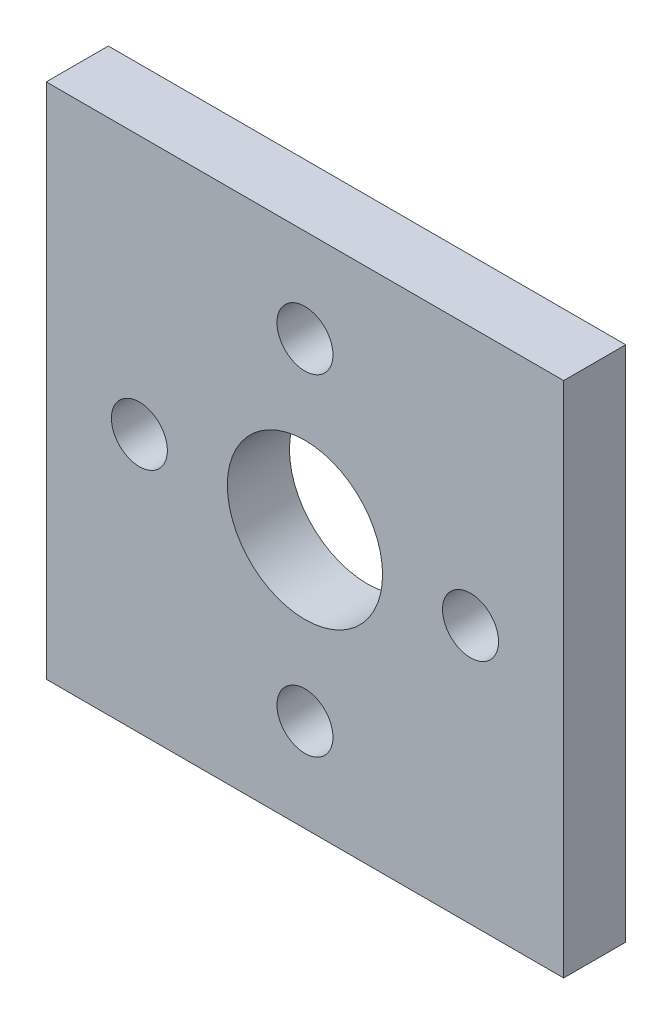
ISO-10303-21;
HEADER;
FILE_DESCRIPTION(('STEP AP214'),'2;1');
FILE_NAME('part.step','',(''),(''),'','','');
FILE_SCHEMA(('AUTOMOTIVE_DESIGN { 1 0 10303 214 1 1 1 1 }'));
ENDSEC;
DATA;
#1=APPLICATION_CONTEXT('core data for automotive mechanical design processes');
#2=APPLICATION_PROTOCOL_DEFINITION('international standard','automotive_design',2000,#1);
#3=PRODUCT_CONTEXT('',#1,'mechanical');
#4=PRODUCT('Part','Part','',(#3));
#5=PRODUCT_RELATED_PRODUCT_CATEGORY('part','',(#4));
#6=PRODUCT_DEFINITION_FORMATION('','',#4);
#7=PRODUCT_DEFINITION_CONTEXT('part definition',#1,'design');
#8=PRODUCT_DEFINITION('design','',#6,#7);
#9=PRODUCT_DEFINITION_SHAPE('','',#8);
#10=(LENGTH_UNIT() NAMED_UNIT(*) SI_UNIT(.MILLI.,.METRE.));
#11=(NAMED_UNIT(*) PLANE_ANGLE_UNIT() SI_UNIT($,.RADIAN.));
#12=(NAMED_UNIT(*) SI_UNIT($,.STERADIAN.) SOLID_ANGLE_UNIT());
#13=UNCERTAINTY_MEASURE_WITH_UNIT(LENGTH_MEASURE(1.E-05),#10,'distance_accuracy_value','');
#14=(GEOMETRIC_REPRESENTATION_CONTEXT(3) GLOBAL_UNCERTAINTY_ASSIGNED_CONTEXT((#13)) GLOBAL_UNIT_ASSIGNED_CONTEXT((#10,
#11,#12)) REPRESENTATION_CONTEXT('',''));
#15=CARTESIAN_POINT('',(0.,0.,0.));
#16=DIRECTION('',(0.,0.,1.));
#17=DIRECTION('',(1.,0.,0.));
#18=AXIS2_PLACEMENT_3D('',#15,#16,#17);
#19=CARTESIAN_POINT('',(0.,0.,3.));
#20=DIRECTION('',(0.,0.,1.));
#21=DIRECTION('',(1.,0.,0.));
#22=AXIS2_PLACEMENT_3D('',#19,#20,#21);
#23=PLANE('',#22);
#24=CARTESIAN_POINT('',(8.,0.,3.));
#25=DIRECTION('',(0.,0.,1.));
#26=DIRECTION('',(1.,0.,0.));
#27=AXIS2_PLACEMENT_3D('',#24,#25,#26);
#28=CIRCLE('',#27,1.35255);
#29=CARTESIAN_POINT('',(9.35255,0.,3.));
#30=VERTEX_POINT('',#29);
#31=EDGE_CURVE('E127',#30,#30,#28,.T.);
#32=ORIENTED_EDGE('',*,*,#31,.F.);
#33=EDGE_LOOP('',(#32));
#34=FACE_BOUND('',#33,.T.);
#35=CARTESIAN_POINT('',(0.,8.,3.));
#36=DIRECTION('',(0.,0.,1.));
#37=DIRECTION('',(1.,0.,0.));
#38=AXIS2_PLACEMENT_3D('',#35,#36,#37);
#39=CIRCLE('',#38,1.35255);
#40=CARTESIAN_POINT('',(1.35255,8.,3.));
#41=VERTEX_POINT('',#40);
#42=EDGE_CURVE('E115',#41,#41,#39,.T.);
#43=ORIENTED_EDGE('',*,*,#42,.F.);
#44=EDGE_LOOP('',(#43));
#45=FACE_BOUND('',#44,.T.);
#46=DIRECTION('',(0.,-1.,0.));
#47=VECTOR('',#46,1.);
#48=CARTESIAN_POINT('',(-12.5,12.5,3.));
#49=LINE('',#48,#47);
#50=CARTESIAN_POINT('',(-12.5,12.5,3.));
#51=VERTEX_POINT('',#50);
#52=CARTESIAN_POINT('',(-12.5,-12.5,3.));
#53=VERTEX_POINT('',#52);
#54=EDGE_CURVE('E85',#51,#53,#49,.T.);
#55=ORIENTED_EDGE('',*,*,#54,.T.);
#56=DIRECTION('',(1.,0.,0.));
#57=VECTOR('',#56,1.);
#58=CARTESIAN_POINT('',(-12.5,-12.5,3.));
#59=LINE('',#58,#57);
#60=CARTESIAN_POINT('',(12.5,-12.5,3.));
#61=VERTEX_POINT('',#60);
#62=EDGE_CURVE('E80',#53,#61,#59,.T.);
#63=ORIENTED_EDGE('',*,*,#62,.T.);
#64=DIRECTION('',(0.,1.,0.));
#65=VECTOR('',#64,1.);
#66=CARTESIAN_POINT('',(12.5,12.5,3.));
#67=LINE('',#66,#65);
#68=CARTESIAN_POINT('',(12.5,12.5,3.));
#69=VERTEX_POINT('',#68);
#70=EDGE_CURVE('E83',#61,#69,#67,.T.);
#71=ORIENTED_EDGE('',*,*,#70,.T.);
#72=DIRECTION('',(-1.,0.,0.));
#73=VECTOR('',#72,1.);
#74=CARTESIAN_POINT('',(-12.5,12.5,3.));
#75=LINE('',#74,#73);
#76=EDGE_CURVE('E50',#69,#51,#75,.T.);
#77=ORIENTED_EDGE('',*,*,#76,.T.);
#78=EDGE_LOOP('',(#55,#63,#71,#77));
#79=FACE_BOUND('',#78,.T.);
#80=CARTESIAN_POINT('',(0.,0.,3.));
#81=DIRECTION('',(0.,0.,1.));
#82=DIRECTION('',(1.,0.,0.));
#83=AXIS2_PLACEMENT_3D('',#80,#81,#82);
#84=CIRCLE('',#83,3.75);
#85=CARTESIAN_POINT('',(3.75,0.,3.));
#86=VERTEX_POINT('',#85);
#87=EDGE_CURVE('E100',#86,#86,#84,.T.);
#88=ORIENTED_EDGE('',*,*,#87,.F.);
#89=EDGE_LOOP('',(#88));
#90=FACE_BOUND('',#89,.T.);
#91=CARTESIAN_POINT('',(0.,-8.,3.));
#92=DIRECTION('',(0.,0.,1.));
#93=DIRECTION('',(1.,0.,0.));
#94=AXIS2_PLACEMENT_3D('',#91,#92,#93);
#95=CIRCLE('',#94,1.35255);
#96=CARTESIAN_POINT('',(1.35255,-8.,3.));
#97=VERTEX_POINT('',#96);
#98=EDGE_CURVE('E121',#97,#97,#95,.T.);
#99=ORIENTED_EDGE('',*,*,#98,.F.);
#100=EDGE_LOOP('',(#99));
#101=FACE_BOUND('',#100,.T.);
#102=CARTESIAN_POINT('',(-8.,0.,3.));
#103=DIRECTION('',(0.,0.,1.));
#104=DIRECTION('',(1.,0.,0.));
#105=AXIS2_PLACEMENT_3D('',#102,#103,#104);
#106=CIRCLE('',#105,1.35255);
#107=CARTESIAN_POINT('',(-6.64745,0.,3.));
#108=VERTEX_POINT('',#107);
#109=EDGE_CURVE('E133',#108,#108,#106,.T.);
#110=ORIENTED_EDGE('',*,*,#109,.F.);
#111=EDGE_LOOP('',(#110));
#112=FACE_BOUND('',#111,.T.);
#113=ADVANCED_FACE('F33',(#34,#45,#79,#90,#101,#112),#23,.T.);
#114=CARTESIAN_POINT('',(0.,0.,0.));
#115=DIRECTION('',(0.,0.,1.));
#116=DIRECTION('',(1.,0.,0.));
#117=AXIS2_PLACEMENT_3D('',#114,#115,#116);
#118=PLANE('',#117);
#119=DIRECTION('',(0.,-1.,0.));
#120=VECTOR('',#119,1.);
#121=CARTESIAN_POINT('',(-12.5,12.5,0.));
#122=LINE('',#121,#120);
#123=CARTESIAN_POINT('',(-12.5,12.5,0.));
#124=VERTEX_POINT('',#123);
#125=CARTESIAN_POINT('',(-12.5,-12.5,0.));
#126=VERTEX_POINT('',#125);
#127=EDGE_CURVE('E97',#124,#126,#122,.T.);
#128=ORIENTED_EDGE('',*,*,#127,.F.);
#129=DIRECTION('',(-1.,0.,0.));
#130=VECTOR('',#129,1.);
#131=CARTESIAN_POINT('',(-12.5,12.5,0.));
#132=LINE('',#131,#130);
#133=CARTESIAN_POINT('',(12.5,12.5,0.));
#134=VERTEX_POINT('',#133);
#135=EDGE_CURVE('E73',#134,#124,#132,.T.);
#136=ORIENTED_EDGE('',*,*,#135,.F.);
#137=DIRECTION('',(0.,1.,0.));
#138=VECTOR('',#137,1.);
#139=CARTESIAN_POINT('',(12.5,12.5,0.));
#140=LINE('',#139,#138);
#141=CARTESIAN_POINT('',(12.5,-12.5,0.));
#142=VERTEX_POINT('',#141);
#143=EDGE_CURVE('E67',#142,#134,#140,.T.);
#144=ORIENTED_EDGE('',*,*,#143,.F.);
#145=DIRECTION('',(1.,0.,0.));
#146=VECTOR('',#145,1.);
#147=CARTESIAN_POINT('',(-12.5,-12.5,0.));
#148=LINE('',#147,#146);
#149=EDGE_CURVE('E89',#126,#142,#148,.T.);
#150=ORIENTED_EDGE('',*,*,#149,.F.);
#151=EDGE_LOOP('',(#128,#136,#144,#150));
#152=FACE_BOUND('',#151,.T.);
#153=CARTESIAN_POINT('',(0.,0.,0.));
#154=DIRECTION('',(0.,0.,1.));
#155=DIRECTION('',(1.,0.,0.));
#156=AXIS2_PLACEMENT_3D('',#153,#154,#155);
#157=CIRCLE('',#156,3.75);
#158=CARTESIAN_POINT('',(3.75,0.,0.));
#159=VERTEX_POINT('',#158);
#160=EDGE_CURVE('E112',#159,#159,#157,.T.);
#161=ORIENTED_EDGE('',*,*,#160,.T.);
#162=EDGE_LOOP('',(#161));
#163=FACE_BOUND('',#162,.T.);
#164=CARTESIAN_POINT('',(0.,8.,0.));
#165=DIRECTION('',(0.,0.,1.));
#166=DIRECTION('',(1.,0.,0.));
#167=AXIS2_PLACEMENT_3D('',#164,#165,#166);
#168=CIRCLE('',#167,1.35255);
#169=CARTESIAN_POINT('',(1.35255,8.,0.));
#170=VERTEX_POINT('',#169);
#171=EDGE_CURVE('E118',#170,#170,#168,.T.);
#172=ORIENTED_EDGE('',*,*,#171,.T.);
#173=EDGE_LOOP('',(#172));
#174=FACE_BOUND('',#173,.T.);
#175=CARTESIAN_POINT('',(0.,-8.,0.));
#176=DIRECTION('',(0.,0.,1.));
#177=DIRECTION('',(1.,0.,0.));
#178=AXIS2_PLACEMENT_3D('',#175,#176,#177);
#179=CIRCLE('',#178,1.35255);
#180=CARTESIAN_POINT('',(1.35255,-8.,0.));
#181=VERTEX_POINT('',#180);
#182=EDGE_CURVE('E124',#181,#181,#179,.T.);
#183=ORIENTED_EDGE('',*,*,#182,.T.);
#184=EDGE_LOOP('',(#183));
#185=FACE_BOUND('',#184,.T.);
#186=CARTESIAN_POINT('',(8.,0.,0.));
#187=DIRECTION('',(0.,0.,1.));
#188=DIRECTION('',(1.,0.,0.));
#189=AXIS2_PLACEMENT_3D('',#186,#187,#188);
#190=CIRCLE('',#189,1.35255);
#191=CARTESIAN_POINT('',(9.35255,0.,0.));
#192=VERTEX_POINT('',#191);
#193=EDGE_CURVE('E130',#192,#192,#190,.T.);
#194=ORIENTED_EDGE('',*,*,#193,.T.);
#195=EDGE_LOOP('',(#194));
#196=FACE_BOUND('',#195,.T.);
#197=CARTESIAN_POINT('',(-8.,0.,0.));
#198=DIRECTION('',(0.,0.,1.));
#199=DIRECTION('',(1.,0.,0.));
#200=AXIS2_PLACEMENT_3D('',#197,#198,#199);
#201=CIRCLE('',#200,1.35255);
#202=CARTESIAN_POINT('',(-6.64745,0.,0.));
#203=VERTEX_POINT('',#202);
#204=EDGE_CURVE('E136',#203,#203,#201,.T.);
#205=ORIENTED_EDGE('',*,*,#204,.T.);
#206=EDGE_LOOP('',(#205));
#207=FACE_BOUND('',#206,.T.);
#208=ADVANCED_FACE('F108',(#152,#163,#174,#185,#196,#207),#118,.F.);
#209=CARTESIAN_POINT('',(-12.5,12.5,3.));
#210=DIRECTION('',(1.,0.,0.));
#211=DIRECTION('',(0.,1.,0.));
#212=AXIS2_PLACEMENT_3D('',#209,#210,#211);
#213=PLANE('',#212);
#214=ORIENTED_EDGE('',*,*,#127,.T.);
#215=DIRECTION('',(0.,0.,-1.));
#216=VECTOR('',#215,1.);
#217=CARTESIAN_POINT('',(-12.5,-12.5,3.));
#218=LINE('',#217,#216);
#219=EDGE_CURVE('E11',#53,#126,#218,.T.);
#220=ORIENTED_EDGE('',*,*,#219,.F.);
#221=ORIENTED_EDGE('',*,*,#54,.F.);
#222=DIRECTION('',(0.,0.,-1.));
#223=VECTOR('',#222,1.);
#224=CARTESIAN_POINT('',(-12.5,12.5,3.));
#225=LINE('',#224,#223);
#226=EDGE_CURVE('E93',#51,#124,#225,.T.);
#227=ORIENTED_EDGE('',*,*,#226,.T.);
#228=EDGE_LOOP('',(#214,#220,#221,#227));
#229=FACE_BOUND('',#228,.T.);
#230=ADVANCED_FACE('F35',(#229),#213,.F.);
#231=CARTESIAN_POINT('',(-12.5,-12.5,3.));
#232=DIRECTION('',(0.,1.,0.));
#233=DIRECTION('',(0.,0.,1.));
#234=AXIS2_PLACEMENT_3D('',#231,#232,#233);
#235=PLANE('',#234);
#236=ORIENTED_EDGE('',*,*,#149,.T.);
#237=DIRECTION('',(0.,0.,-1.));
#238=VECTOR('',#237,1.);
#239=CARTESIAN_POINT('',(12.5,-12.5,3.));
#240=LINE('',#239,#238);
#241=EDGE_CURVE('E42',#61,#142,#240,.T.);
#242=ORIENTED_EDGE('',*,*,#241,.F.);
#243=ORIENTED_EDGE('',*,*,#62,.F.);
#244=ORIENTED_EDGE('',*,*,#219,.T.);
#245=EDGE_LOOP('',(#236,#242,#243,#244));
#246=FACE_BOUND('',#245,.T.);
#247=ADVANCED_FACE('F88',(#246),#235,.F.);
#248=CARTESIAN_POINT('',(12.5,12.5,3.));
#249=DIRECTION('',(-1.,0.,0.));
#250=DIRECTION('',(0.,0.,1.));
#251=AXIS2_PLACEMENT_3D('',#248,#249,#250);
#252=PLANE('',#251);
#253=ORIENTED_EDGE('',*,*,#143,.T.);
#254=DIRECTION('',(0.,0.,-1.));
#255=VECTOR('',#254,1.);
#256=CARTESIAN_POINT('',(12.5,12.5,3.));
#257=LINE('',#256,#255);
#258=EDGE_CURVE('E90',#69,#134,#257,.T.);
#259=ORIENTED_EDGE('',*,*,#258,.F.);
#260=ORIENTED_EDGE('',*,*,#70,.F.);
#261=ORIENTED_EDGE('',*,*,#241,.T.);
#262=EDGE_LOOP('',(#253,#259,#260,#261));
#263=FACE_BOUND('',#262,.T.);
#264=ADVANCED_FACE('F91',(#263),#252,.F.);
#265=CARTESIAN_POINT('',(-12.5,12.5,3.));
#266=DIRECTION('',(0.,-1.,0.));
#267=DIRECTION('',(0.,0.,-1.));
#268=AXIS2_PLACEMENT_3D('',#265,#266,#267);
#269=PLANE('',#268);
#270=ORIENTED_EDGE('',*,*,#135,.T.);
#271=ORIENTED_EDGE('',*,*,#226,.F.);
#272=ORIENTED_EDGE('',*,*,#76,.F.);
#273=ORIENTED_EDGE('',*,*,#258,.T.);
#274=EDGE_LOOP('',(#270,#271,#272,#273));
#275=FACE_BOUND('',#274,.T.);
#276=ADVANCED_FACE('F105',(#275),#269,.F.);
#277=CARTESIAN_POINT('',(0.,0.,3.));
#278=DIRECTION('',(0.,0.,-1.));
#279=DIRECTION('',(-1.,0.,0.));
#280=AXIS2_PLACEMENT_3D('',#277,#278,#279);
#281=CYLINDRICAL_SURFACE('',#280,3.75);
#282=ORIENTED_EDGE('',*,*,#87,.T.);
#283=EDGE_LOOP('',(#282));
#284=FACE_BOUND('',#283,.T.);
#285=ORIENTED_EDGE('',*,*,#160,.F.);
#286=EDGE_LOOP('',(#285));
#287=FACE_BOUND('',#286,.T.);
#288=ADVANCED_FACE('F155',(#284,#287),#281,.F.);
#289=CARTESIAN_POINT('',(0.,8.,3.));
#290=DIRECTION('',(0.,0.,-1.));
#291=DIRECTION('',(-1.,0.,0.));
#292=AXIS2_PLACEMENT_3D('',#289,#290,#291);
#293=CYLINDRICAL_SURFACE('',#292,1.35255);
#294=ORIENTED_EDGE('',*,*,#42,.T.);
#295=EDGE_LOOP('',(#294));
#296=FACE_BOUND('',#295,.T.);
#297=ORIENTED_EDGE('',*,*,#171,.F.);
#298=EDGE_LOOP('',(#297));
#299=FACE_BOUND('',#298,.T.);
#300=ADVANCED_FACE('F201',(#296,#299),#293,.F.);
#301=CARTESIAN_POINT('',(0.,-8.,3.));
#302=DIRECTION('',(0.,0.,-1.));
#303=DIRECTION('',(-1.,0.,0.));
#304=AXIS2_PLACEMENT_3D('',#301,#302,#303);
#305=CYLINDRICAL_SURFACE('',#304,1.35255);
#306=ORIENTED_EDGE('',*,*,#98,.T.);
#307=EDGE_LOOP('',(#306));
#308=FACE_BOUND('',#307,.T.);
#309=ORIENTED_EDGE('',*,*,#182,.F.);
#310=EDGE_LOOP('',(#309));
#311=FACE_BOUND('',#310,.T.);
#312=ADVANCED_FACE('F209',(#308,#311),#305,.F.);
#313=CARTESIAN_POINT('',(8.,0.,3.));
#314=DIRECTION('',(0.,0.,-1.));
#315=DIRECTION('',(-1.,0.,0.));
#316=AXIS2_PLACEMENT_3D('',#313,#314,#315);
#317=CYLINDRICAL_SURFACE('',#316,1.35255);
#318=ORIENTED_EDGE('',*,*,#31,.T.);
#319=EDGE_LOOP('',(#318));
#320=FACE_BOUND('',#319,.T.);
#321=ORIENTED_EDGE('',*,*,#193,.F.);
#322=EDGE_LOOP('',(#321));
#323=FACE_BOUND('',#322,.T.);
#324=ADVANCED_FACE('F217',(#320,#323),#317,.F.);
#325=CARTESIAN_POINT('',(-8.,0.,3.));
#326=DIRECTION('',(0.,0.,-1.));
#327=DIRECTION('',(-1.,0.,0.));
#328=AXIS2_PLACEMENT_3D('',#325,#326,#327);
#329=CYLINDRICAL_SURFACE('',#328,1.35255);
#330=ORIENTED_EDGE('',*,*,#109,.T.);
#331=EDGE_LOOP('',(#330));
#332=FACE_BOUND('',#331,.T.);
#333=ORIENTED_EDGE('',*,*,#204,.F.);
#334=EDGE_LOOP('',(#333));
#335=FACE_BOUND('',#334,.T.);
#336=ADVANCED_FACE('F142',(#332,#335),#329,.F.);
#337=CLOSED_SHELL('',(#113,#208,#230,#247,#264,#276,#288,#300,#312,#324,#336));
#338=MANIFOLD_SOLID_BREP('B2',#337);
#339=ADVANCED_BREP_SHAPE_REPRESENTATION('',(#18,#338),#14);
#340=SHAPE_DEFINITION_REPRESENTATION(#9,#339);
ENDSEC;
END-ISO-10303-21;
